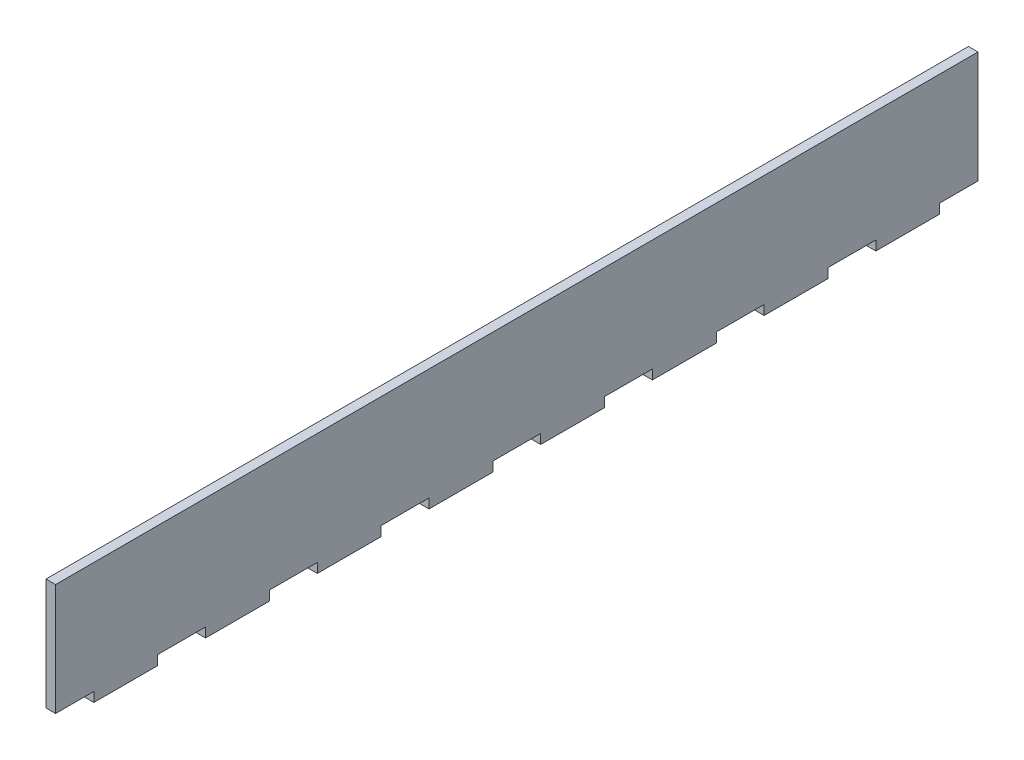
ISO-10303-21;
HEADER;
FILE_DESCRIPTION(('STEP AP214'),'2;1');
FILE_NAME('part.step','',(''),(''),'','','');
FILE_SCHEMA(('AUTOMOTIVE_DESIGN { 1 0 10303 214 1 1 1 1 }'));
ENDSEC;
DATA;
#1=APPLICATION_CONTEXT('core data for automotive mechanical design processes');
#2=APPLICATION_PROTOCOL_DEFINITION('international standard','automotive_design',2000,#1);
#3=PRODUCT_CONTEXT('',#1,'mechanical');
#4=PRODUCT('Part','Part','',(#3));
#5=PRODUCT_RELATED_PRODUCT_CATEGORY('part','',(#4));
#6=PRODUCT_DEFINITION_FORMATION('','',#4);
#7=PRODUCT_DEFINITION_CONTEXT('part definition',#1,'design');
#8=PRODUCT_DEFINITION('design','',#6,#7);
#9=PRODUCT_DEFINITION_SHAPE('','',#8);
#10=(LENGTH_UNIT() NAMED_UNIT(*) SI_UNIT(.MILLI.,.METRE.));
#11=(NAMED_UNIT(*) PLANE_ANGLE_UNIT() SI_UNIT($,.RADIAN.));
#12=(NAMED_UNIT(*) SI_UNIT($,.STERADIAN.) SOLID_ANGLE_UNIT());
#13=UNCERTAINTY_MEASURE_WITH_UNIT(LENGTH_MEASURE(1.E-05),#10,'distance_accuracy_value','');
#14=(GEOMETRIC_REPRESENTATION_CONTEXT(3) GLOBAL_UNCERTAINTY_ASSIGNED_CONTEXT((#13)) GLOBAL_UNIT_ASSIGNED_CONTEXT((#10,
#11,#12)) REPRESENTATION_CONTEXT('',''));
#15=CARTESIAN_POINT('',(0.,0.,0.));
#16=DIRECTION('',(0.,0.,1.));
#17=DIRECTION('',(1.,0.,0.));
#18=AXIS2_PLACEMENT_3D('',#15,#16,#17);
#19=CARTESIAN_POINT('',(3.,0.,0.));
#20=DIRECTION('',(0.,0.,1.));
#21=DIRECTION('',(1.,0.,0.));
#22=AXIS2_PLACEMENT_3D('',#19,#20,#21);
#23=PLANE('',#22);
#24=DIRECTION('',(0.,1.,0.));
#25=VECTOR('',#24,1.);
#26=CARTESIAN_POINT('',(0.,0.,0.));
#27=LINE('',#26,#25);
#28=CARTESIAN_POINT('',(0.,0.,0.));
#29=VERTEX_POINT('',#28);
#30=CARTESIAN_POINT('',(0.,35.,0.));
#31=VERTEX_POINT('',#30);
#32=EDGE_CURVE('E300',#29,#31,#27,.T.);
#33=ORIENTED_EDGE('',*,*,#32,.F.);
#34=DIRECTION('',(-1.,0.,0.));
#35=VECTOR('',#34,1.);
#36=CARTESIAN_POINT('',(3.,0.,0.));
#37=LINE('',#36,#35);
#38=CARTESIAN_POINT('',(3.,0.,0.));
#39=VERTEX_POINT('',#38);
#40=EDGE_CURVE('E11',#39,#29,#37,.T.);
#41=ORIENTED_EDGE('',*,*,#40,.F.);
#42=DIRECTION('',(0.,1.,0.));
#43=VECTOR('',#42,1.);
#44=CARTESIAN_POINT('',(3.,0.,0.));
#45=LINE('',#44,#43);
#46=CARTESIAN_POINT('',(3.,35.,0.));
#47=VERTEX_POINT('',#46);
#48=EDGE_CURVE('E387',#39,#47,#45,.T.);
#49=ORIENTED_EDGE('',*,*,#48,.T.);
#50=DIRECTION('',(-1.,0.,0.));
#51=VECTOR('',#50,1.);
#52=CARTESIAN_POINT('',(3.,35.,0.));
#53=LINE('',#52,#51);
#54=EDGE_CURVE('E36',#47,#31,#53,.T.);
#55=ORIENTED_EDGE('',*,*,#54,.T.);
#56=EDGE_LOOP('',(#33,#41,#49,#55));
#57=FACE_BOUND('',#56,.T.);
#58=ADVANCED_FACE('F33',(#57),#23,.T.);
#59=CARTESIAN_POINT('',(3.,0.,0.));
#60=DIRECTION('',(0.,1.,0.));
#61=DIRECTION('',(0.,0.,1.));
#62=AXIS2_PLACEMENT_3D('',#59,#60,#61);
#63=PLANE('',#62);
#64=DIRECTION('',(0.,0.,-1.));
#65=VECTOR('',#64,1.);
#66=CARTESIAN_POINT('',(0.,0.,0.));
#67=LINE('',#66,#65);
#68=CARTESIAN_POINT('',(0.,0.,-12.));
#69=VERTEX_POINT('',#68);
#70=EDGE_CURVE('E162',#29,#69,#67,.T.);
#71=ORIENTED_EDGE('',*,*,#70,.T.);
#72=DIRECTION('',(-1.,0.,0.));
#73=VECTOR('',#72,1.);
#74=CARTESIAN_POINT('',(3.,0.,-12.));
#75=LINE('',#74,#73);
#76=CARTESIAN_POINT('',(3.,0.,-12.));
#77=VERTEX_POINT('',#76);
#78=EDGE_CURVE('E42',#77,#69,#75,.T.);
#79=ORIENTED_EDGE('',*,*,#78,.F.);
#80=DIRECTION('',(0.,0.,-1.));
#81=VECTOR('',#80,1.);
#82=CARTESIAN_POINT('',(3.,0.,0.));
#83=LINE('',#82,#81);
#84=EDGE_CURVE('E278',#39,#77,#83,.T.);
#85=ORIENTED_EDGE('',*,*,#84,.F.);
#86=ORIENTED_EDGE('',*,*,#40,.T.);
#87=EDGE_LOOP('',(#71,#79,#85,#86));
#88=FACE_BOUND('',#87,.T.);
#89=ADVANCED_FACE('F691',(#88),#63,.F.);
#90=CARTESIAN_POINT('',(3.,0.,-12.));
#91=DIRECTION('',(0.,0.,-1.));
#92=DIRECTION('',(0.,1.,0.));
#93=AXIS2_PLACEMENT_3D('',#90,#91,#92);
#94=PLANE('',#93);
#95=DIRECTION('',(0.,-1.,0.));
#96=VECTOR('',#95,1.);
#97=CARTESIAN_POINT('',(0.,0.,-12.));
#98=LINE('',#97,#96);
#99=CARTESIAN_POINT('',(0.,-3.,-12.));
#100=VERTEX_POINT('',#99);
#101=EDGE_CURVE('E285',#69,#100,#98,.T.);
#102=ORIENTED_EDGE('',*,*,#101,.T.);
#103=DIRECTION('',(-1.,0.,0.));
#104=VECTOR('',#103,1.);
#105=CARTESIAN_POINT('',(3.,-3.,-12.));
#106=LINE('',#105,#104);
#107=CARTESIAN_POINT('',(3.,-3.,-12.));
#108=VERTEX_POINT('',#107);
#109=EDGE_CURVE('E282',#108,#100,#106,.T.);
#110=ORIENTED_EDGE('',*,*,#109,.F.);
#111=DIRECTION('',(0.,-1.,0.));
#112=VECTOR('',#111,1.);
#113=CARTESIAN_POINT('',(3.,0.,-12.));
#114=LINE('',#113,#112);
#115=EDGE_CURVE('E270',#77,#108,#114,.T.);
#116=ORIENTED_EDGE('',*,*,#115,.F.);
#117=ORIENTED_EDGE('',*,*,#78,.T.);
#118=EDGE_LOOP('',(#102,#110,#116,#117));
#119=FACE_BOUND('',#118,.T.);
#120=ADVANCED_FACE('F283',(#119),#94,.F.);
#121=CARTESIAN_POINT('',(3.,-3.,-12.));
#122=DIRECTION('',(0.,1.,0.));
#123=DIRECTION('',(0.,0.,1.));
#124=AXIS2_PLACEMENT_3D('',#121,#122,#123);
#125=PLANE('',#124);
#126=DIRECTION('',(0.,0.,-1.));
#127=VECTOR('',#126,1.);
#128=CARTESIAN_POINT('',(0.,-3.,-12.));
#129=LINE('',#128,#127);
#130=CARTESIAN_POINT('',(0.,-3.,-32.));
#131=VERTEX_POINT('',#130);
#132=EDGE_CURVE('E384',#100,#131,#129,.T.);
#133=ORIENTED_EDGE('',*,*,#132,.T.);
#134=DIRECTION('',(-1.,0.,0.));
#135=VECTOR('',#134,1.);
#136=CARTESIAN_POINT('',(3.,-3.,-32.));
#137=LINE('',#136,#135);
#138=CARTESIAN_POINT('',(3.,-3.,-32.));
#139=VERTEX_POINT('',#138);
#140=EDGE_CURVE('E289',#139,#131,#137,.T.);
#141=ORIENTED_EDGE('',*,*,#140,.F.);
#142=DIRECTION('',(0.,0.,-1.));
#143=VECTOR('',#142,1.);
#144=CARTESIAN_POINT('',(3.,-3.,-12.));
#145=LINE('',#144,#143);
#146=EDGE_CURVE('E276',#108,#139,#145,.T.);
#147=ORIENTED_EDGE('',*,*,#146,.F.);
#148=ORIENTED_EDGE('',*,*,#109,.T.);
#149=EDGE_LOOP('',(#133,#141,#147,#148));
#150=FACE_BOUND('',#149,.T.);
#151=ADVANCED_FACE('F291',(#150),#125,.F.);
#152=CARTESIAN_POINT('',(3.,0.,-32.));
#153=DIRECTION('',(0.,0.,-1.));
#154=DIRECTION('',(-1.,0.,0.));
#155=AXIS2_PLACEMENT_3D('',#152,#153,#154);
#156=PLANE('',#155);
#157=DIRECTION('',(0.,-1.,0.));
#158=VECTOR('',#157,1.);
#159=CARTESIAN_POINT('',(0.,0.,-32.));
#160=LINE('',#159,#158);
#161=CARTESIAN_POINT('',(0.,0.,-32.));
#162=VERTEX_POINT('',#161);
#163=EDGE_CURVE('E381',#162,#131,#160,.T.);
#164=ORIENTED_EDGE('',*,*,#163,.F.);
#165=DIRECTION('',(-1.,0.,0.));
#166=VECTOR('',#165,1.);
#167=CARTESIAN_POINT('',(3.,0.,-32.));
#168=LINE('',#167,#166);
#169=CARTESIAN_POINT('',(3.,0.,-32.));
#170=VERTEX_POINT('',#169);
#171=EDGE_CURVE('E391',#170,#162,#168,.T.);
#172=ORIENTED_EDGE('',*,*,#171,.F.);
#173=DIRECTION('',(0.,-1.,0.));
#174=VECTOR('',#173,1.);
#175=CARTESIAN_POINT('',(3.,0.,-32.));
#176=LINE('',#175,#174);
#177=EDGE_CURVE('E293',#170,#139,#176,.T.);
#178=ORIENTED_EDGE('',*,*,#177,.T.);
#179=ORIENTED_EDGE('',*,*,#140,.T.);
#180=EDGE_LOOP('',(#164,#172,#178,#179));
#181=FACE_BOUND('',#180,.T.);
#182=ADVANCED_FACE('F475',(#181),#156,.T.);
#183=CARTESIAN_POINT('',(3.,0.,-32.));
#184=DIRECTION('',(0.,1.,0.));
#185=DIRECTION('',(0.,0.,1.));
#186=AXIS2_PLACEMENT_3D('',#183,#184,#185);
#187=PLANE('',#186);
#188=DIRECTION('',(0.,0.,-1.));
#189=VECTOR('',#188,1.);
#190=CARTESIAN_POINT('',(0.,0.,-32.));
#191=LINE('',#190,#189);
#192=CARTESIAN_POINT('',(0.,0.,-47.));
#193=VERTEX_POINT('',#192);
#194=EDGE_CURVE('E379',#162,#193,#191,.T.);
#195=ORIENTED_EDGE('',*,*,#194,.T.);
#196=DIRECTION('',(-1.,0.,0.));
#197=VECTOR('',#196,1.);
#198=CARTESIAN_POINT('',(3.,0.,-47.));
#199=LINE('',#198,#197);
#200=CARTESIAN_POINT('',(3.,0.,-47.));
#201=VERTEX_POINT('',#200);
#202=EDGE_CURVE('E393',#201,#193,#199,.T.);
#203=ORIENTED_EDGE('',*,*,#202,.F.);
#204=DIRECTION('',(0.,0.,-1.));
#205=VECTOR('',#204,1.);
#206=CARTESIAN_POINT('',(3.,0.,-32.));
#207=LINE('',#206,#205);
#208=EDGE_CURVE('E295',#170,#201,#207,.T.);
#209=ORIENTED_EDGE('',*,*,#208,.F.);
#210=ORIENTED_EDGE('',*,*,#171,.T.);
#211=EDGE_LOOP('',(#195,#203,#209,#210));
#212=FACE_BOUND('',#211,.T.);
#213=ADVANCED_FACE('F482',(#212),#187,.F.);
#214=CARTESIAN_POINT('',(3.,0.,-47.));
#215=DIRECTION('',(0.,0.,-1.));
#216=DIRECTION('',(0.,1.,0.));
#217=AXIS2_PLACEMENT_3D('',#214,#215,#216);
#218=PLANE('',#217);
#219=DIRECTION('',(0.,-1.,0.));
#220=VECTOR('',#219,1.);
#221=CARTESIAN_POINT('',(0.,0.,-47.));
#222=LINE('',#221,#220);
#223=CARTESIAN_POINT('',(0.,-3.,-47.));
#224=VERTEX_POINT('',#223);
#225=EDGE_CURVE('E377',#193,#224,#222,.T.);
#226=ORIENTED_EDGE('',*,*,#225,.T.);
#227=DIRECTION('',(-1.,0.,0.));
#228=VECTOR('',#227,1.);
#229=CARTESIAN_POINT('',(3.,-3.,-47.));
#230=LINE('',#229,#228);
#231=CARTESIAN_POINT('',(3.,-3.,-47.));
#232=VERTEX_POINT('',#231);
#233=EDGE_CURVE('E396',#232,#224,#230,.T.);
#234=ORIENTED_EDGE('',*,*,#233,.F.);
#235=DIRECTION('',(0.,-1.,0.));
#236=VECTOR('',#235,1.);
#237=CARTESIAN_POINT('',(3.,0.,-47.));
#238=LINE('',#237,#236);
#239=EDGE_CURVE('E479',#201,#232,#238,.T.);
#240=ORIENTED_EDGE('',*,*,#239,.F.);
#241=ORIENTED_EDGE('',*,*,#202,.T.);
#242=EDGE_LOOP('',(#226,#234,#240,#241));
#243=FACE_BOUND('',#242,.T.);
#244=ADVANCED_FACE('F484',(#243),#218,.F.);
#245=CARTESIAN_POINT('',(3.,-3.,-47.));
#246=DIRECTION('',(0.,1.,0.));
#247=DIRECTION('',(0.,0.,1.));
#248=AXIS2_PLACEMENT_3D('',#245,#246,#247);
#249=PLANE('',#248);
#250=DIRECTION('',(0.,0.,-1.));
#251=VECTOR('',#250,1.);
#252=CARTESIAN_POINT('',(0.,-3.,-47.));
#253=LINE('',#252,#251);
#254=CARTESIAN_POINT('',(0.,-3.,-67.));
#255=VERTEX_POINT('',#254);
#256=EDGE_CURVE('E374',#224,#255,#253,.T.);
#257=ORIENTED_EDGE('',*,*,#256,.T.);
#258=DIRECTION('',(-1.,0.,0.));
#259=VECTOR('',#258,1.);
#260=CARTESIAN_POINT('',(3.,-3.,-67.));
#261=LINE('',#260,#259);
#262=CARTESIAN_POINT('',(3.,-3.,-67.));
#263=VERTEX_POINT('',#262);
#264=EDGE_CURVE('E399',#263,#255,#261,.T.);
#265=ORIENTED_EDGE('',*,*,#264,.F.);
#266=DIRECTION('',(0.,0.,-1.));
#267=VECTOR('',#266,1.);
#268=CARTESIAN_POINT('',(3.,-3.,-47.));
#269=LINE('',#268,#267);
#270=EDGE_CURVE('E486',#232,#263,#269,.T.);
#271=ORIENTED_EDGE('',*,*,#270,.F.);
#272=ORIENTED_EDGE('',*,*,#233,.T.);
#273=EDGE_LOOP('',(#257,#265,#271,#272));
#274=FACE_BOUND('',#273,.T.);
#275=ADVANCED_FACE('F681',(#274),#249,.F.);
#276=CARTESIAN_POINT('',(3.,0.,-67.));
#277=DIRECTION('',(0.,0.,-1.));
#278=DIRECTION('',(-1.,0.,0.));
#279=AXIS2_PLACEMENT_3D('',#276,#277,#278);
#280=PLANE('',#279);
#281=DIRECTION('',(0.,-1.,0.));
#282=VECTOR('',#281,1.);
#283=CARTESIAN_POINT('',(0.,0.,-67.));
#284=LINE('',#283,#282);
#285=CARTESIAN_POINT('',(0.,0.,-67.));
#286=VERTEX_POINT('',#285);
#287=EDGE_CURVE('E371',#286,#255,#284,.T.);
#288=ORIENTED_EDGE('',*,*,#287,.F.);
#289=DIRECTION('',(-1.,0.,0.));
#290=VECTOR('',#289,1.);
#291=CARTESIAN_POINT('',(3.,0.,-67.));
#292=LINE('',#291,#290);
#293=CARTESIAN_POINT('',(3.,0.,-67.));
#294=VERTEX_POINT('',#293);
#295=EDGE_CURVE('E401',#294,#286,#292,.T.);
#296=ORIENTED_EDGE('',*,*,#295,.F.);
#297=DIRECTION('',(0.,-1.,0.));
#298=VECTOR('',#297,1.);
#299=CARTESIAN_POINT('',(3.,0.,-67.));
#300=LINE('',#299,#298);
#301=EDGE_CURVE('E488',#294,#263,#300,.T.);
#302=ORIENTED_EDGE('',*,*,#301,.T.);
#303=ORIENTED_EDGE('',*,*,#264,.T.);
#304=EDGE_LOOP('',(#288,#296,#302,#303));
#305=FACE_BOUND('',#304,.T.);
#306=ADVANCED_FACE('F678',(#305),#280,.T.);
#307=CARTESIAN_POINT('',(3.,0.,-67.));
#308=DIRECTION('',(0.,1.,0.));
#309=DIRECTION('',(0.,0.,1.));
#310=AXIS2_PLACEMENT_3D('',#307,#308,#309);
#311=PLANE('',#310);
#312=DIRECTION('',(0.,0.,-1.));
#313=VECTOR('',#312,1.);
#314=CARTESIAN_POINT('',(0.,0.,-67.));
#315=LINE('',#314,#313);
#316=CARTESIAN_POINT('',(0.,0.,-82.));
#317=VERTEX_POINT('',#316);
#318=EDGE_CURVE('E369',#286,#317,#315,.T.);
#319=ORIENTED_EDGE('',*,*,#318,.T.);
#320=DIRECTION('',(-1.,0.,0.));
#321=VECTOR('',#320,1.);
#322=CARTESIAN_POINT('',(3.,0.,-82.));
#323=LINE('',#322,#321);
#324=CARTESIAN_POINT('',(3.,0.,-82.));
#325=VERTEX_POINT('',#324);
#326=EDGE_CURVE('E403',#325,#317,#323,.T.);
#327=ORIENTED_EDGE('',*,*,#326,.F.);
#328=DIRECTION('',(0.,0.,-1.));
#329=VECTOR('',#328,1.);
#330=CARTESIAN_POINT('',(3.,0.,-67.));
#331=LINE('',#330,#329);
#332=EDGE_CURVE('E493',#294,#325,#331,.T.);
#333=ORIENTED_EDGE('',*,*,#332,.F.);
#334=ORIENTED_EDGE('',*,*,#295,.T.);
#335=EDGE_LOOP('',(#319,#327,#333,#334));
#336=FACE_BOUND('',#335,.T.);
#337=ADVANCED_FACE('F673',(#336),#311,.F.);
#338=CARTESIAN_POINT('',(3.,0.,-82.));
#339=DIRECTION('',(0.,0.,-1.));
#340=DIRECTION('',(0.,1.,0.));
#341=AXIS2_PLACEMENT_3D('',#338,#339,#340);
#342=PLANE('',#341);
#343=DIRECTION('',(0.,-1.,0.));
#344=VECTOR('',#343,1.);
#345=CARTESIAN_POINT('',(0.,0.,-82.));
#346=LINE('',#345,#344);
#347=CARTESIAN_POINT('',(0.,-3.,-82.));
#348=VERTEX_POINT('',#347);
#349=EDGE_CURVE('E367',#317,#348,#346,.T.);
#350=ORIENTED_EDGE('',*,*,#349,.T.);
#351=DIRECTION('',(-1.,0.,0.));
#352=VECTOR('',#351,1.);
#353=CARTESIAN_POINT('',(3.,-3.,-82.));
#354=LINE('',#353,#352);
#355=CARTESIAN_POINT('',(3.,-3.,-82.));
#356=VERTEX_POINT('',#355);
#357=EDGE_CURVE('E406',#356,#348,#354,.T.);
#358=ORIENTED_EDGE('',*,*,#357,.F.);
#359=DIRECTION('',(0.,-1.,0.));
#360=VECTOR('',#359,1.);
#361=CARTESIAN_POINT('',(3.,0.,-82.));
#362=LINE('',#361,#360);
#363=EDGE_CURVE('E495',#325,#356,#362,.T.);
#364=ORIENTED_EDGE('',*,*,#363,.F.);
#365=ORIENTED_EDGE('',*,*,#326,.T.);
#366=EDGE_LOOP('',(#350,#358,#364,#365));
#367=FACE_BOUND('',#366,.T.);
#368=ADVANCED_FACE('F669',(#367),#342,.F.);
#369=CARTESIAN_POINT('',(3.,-3.,-82.));
#370=DIRECTION('',(0.,1.,0.));
#371=DIRECTION('',(0.,0.,1.));
#372=AXIS2_PLACEMENT_3D('',#369,#370,#371);
#373=PLANE('',#372);
#374=DIRECTION('',(0.,0.,-1.));
#375=VECTOR('',#374,1.);
#376=CARTESIAN_POINT('',(0.,-3.,-82.));
#377=LINE('',#376,#375);
#378=CARTESIAN_POINT('',(0.,-3.,-102.));
#379=VERTEX_POINT('',#378);
#380=EDGE_CURVE('E364',#348,#379,#377,.T.);
#381=ORIENTED_EDGE('',*,*,#380,.T.);
#382=DIRECTION('',(-1.,0.,0.));
#383=VECTOR('',#382,1.);
#384=CARTESIAN_POINT('',(3.,-3.,-102.));
#385=LINE('',#384,#383);
#386=CARTESIAN_POINT('',(3.,-3.,-102.));
#387=VERTEX_POINT('',#386);
#388=EDGE_CURVE('E409',#387,#379,#385,.T.);
#389=ORIENTED_EDGE('',*,*,#388,.F.);
#390=DIRECTION('',(0.,0.,-1.));
#391=VECTOR('',#390,1.);
#392=CARTESIAN_POINT('',(3.,-3.,-82.));
#393=LINE('',#392,#391);
#394=EDGE_CURVE('E497',#356,#387,#393,.T.);
#395=ORIENTED_EDGE('',*,*,#394,.F.);
#396=ORIENTED_EDGE('',*,*,#357,.T.);
#397=EDGE_LOOP('',(#381,#389,#395,#396));
#398=FACE_BOUND('',#397,.T.);
#399=ADVANCED_FACE('F664',(#398),#373,.F.);
#400=CARTESIAN_POINT('',(3.,0.,-102.));
#401=DIRECTION('',(0.,0.,-1.));
#402=DIRECTION('',(-1.,0.,0.));
#403=AXIS2_PLACEMENT_3D('',#400,#401,#402);
#404=PLANE('',#403);
#405=DIRECTION('',(0.,-1.,0.));
#406=VECTOR('',#405,1.);
#407=CARTESIAN_POINT('',(0.,0.,-102.));
#408=LINE('',#407,#406);
#409=CARTESIAN_POINT('',(0.,0.,-102.));
#410=VERTEX_POINT('',#409);
#411=EDGE_CURVE('E361',#410,#379,#408,.T.);
#412=ORIENTED_EDGE('',*,*,#411,.F.);
#413=DIRECTION('',(-1.,0.,0.));
#414=VECTOR('',#413,1.);
#415=CARTESIAN_POINT('',(3.,0.,-102.));
#416=LINE('',#415,#414);
#417=CARTESIAN_POINT('',(3.,0.,-102.));
#418=VERTEX_POINT('',#417);
#419=EDGE_CURVE('E411',#418,#410,#416,.T.);
#420=ORIENTED_EDGE('',*,*,#419,.F.);
#421=DIRECTION('',(0.,-1.,0.));
#422=VECTOR('',#421,1.);
#423=CARTESIAN_POINT('',(3.,0.,-102.));
#424=LINE('',#423,#422);
#425=EDGE_CURVE('E499',#418,#387,#424,.T.);
#426=ORIENTED_EDGE('',*,*,#425,.T.);
#427=ORIENTED_EDGE('',*,*,#388,.T.);
#428=EDGE_LOOP('',(#412,#420,#426,#427));
#429=FACE_BOUND('',#428,.T.);
#430=ADVANCED_FACE('F658',(#429),#404,.T.);
#431=CARTESIAN_POINT('',(3.,0.,-102.));
#432=DIRECTION('',(0.,1.,0.));
#433=DIRECTION('',(0.,0.,1.));
#434=AXIS2_PLACEMENT_3D('',#431,#432,#433);
#435=PLANE('',#434);
#436=DIRECTION('',(0.,0.,-1.));
#437=VECTOR('',#436,1.);
#438=CARTESIAN_POINT('',(0.,0.,-102.));
#439=LINE('',#438,#437);
#440=CARTESIAN_POINT('',(0.,0.,-117.));
#441=VERTEX_POINT('',#440);
#442=EDGE_CURVE('E359',#410,#441,#439,.T.);
#443=ORIENTED_EDGE('',*,*,#442,.T.);
#444=DIRECTION('',(-1.,0.,0.));
#445=VECTOR('',#444,1.);
#446=CARTESIAN_POINT('',(3.,0.,-117.));
#447=LINE('',#446,#445);
#448=CARTESIAN_POINT('',(3.,0.,-117.));
#449=VERTEX_POINT('',#448);
#450=EDGE_CURVE('E413',#449,#441,#447,.T.);
#451=ORIENTED_EDGE('',*,*,#450,.F.);
#452=DIRECTION('',(0.,0.,-1.));
#453=VECTOR('',#452,1.);
#454=CARTESIAN_POINT('',(3.,0.,-102.));
#455=LINE('',#454,#453);
#456=EDGE_CURVE('E502',#418,#449,#455,.T.);
#457=ORIENTED_EDGE('',*,*,#456,.F.);
#458=ORIENTED_EDGE('',*,*,#419,.T.);
#459=EDGE_LOOP('',(#443,#451,#457,#458));
#460=FACE_BOUND('',#459,.T.);
#461=ADVANCED_FACE('F655',(#460),#435,.F.);
#462=CARTESIAN_POINT('',(3.,0.,-117.));
#463=DIRECTION('',(0.,0.,-1.));
#464=DIRECTION('',(0.,1.,0.));
#465=AXIS2_PLACEMENT_3D('',#462,#463,#464);
#466=PLANE('',#465);
#467=DIRECTION('',(0.,-1.,0.));
#468=VECTOR('',#467,1.);
#469=CARTESIAN_POINT('',(0.,0.,-117.));
#470=LINE('',#469,#468);
#471=CARTESIAN_POINT('',(0.,-3.,-117.));
#472=VERTEX_POINT('',#471);
#473=EDGE_CURVE('E357',#441,#472,#470,.T.);
#474=ORIENTED_EDGE('',*,*,#473,.T.);
#475=DIRECTION('',(-1.,0.,0.));
#476=VECTOR('',#475,1.);
#477=CARTESIAN_POINT('',(3.,-3.,-117.));
#478=LINE('',#477,#476);
#479=CARTESIAN_POINT('',(3.,-3.,-117.));
#480=VERTEX_POINT('',#479);
#481=EDGE_CURVE('E416',#480,#472,#478,.T.);
#482=ORIENTED_EDGE('',*,*,#481,.F.);
#483=DIRECTION('',(0.,-1.,0.));
#484=VECTOR('',#483,1.);
#485=CARTESIAN_POINT('',(3.,0.,-117.));
#486=LINE('',#485,#484);
#487=EDGE_CURVE('E504',#449,#480,#486,.T.);
#488=ORIENTED_EDGE('',*,*,#487,.F.);
#489=ORIENTED_EDGE('',*,*,#450,.T.);
#490=EDGE_LOOP('',(#474,#482,#488,#489));
#491=FACE_BOUND('',#490,.T.);
#492=ADVANCED_FACE('F650',(#491),#466,.F.);
#493=CARTESIAN_POINT('',(3.,-3.,-117.));
#494=DIRECTION('',(0.,1.,0.));
#495=DIRECTION('',(0.,0.,1.));
#496=AXIS2_PLACEMENT_3D('',#493,#494,#495);
#497=PLANE('',#496);
#498=DIRECTION('',(0.,0.,-1.));
#499=VECTOR('',#498,1.);
#500=CARTESIAN_POINT('',(0.,-3.,-117.));
#501=LINE('',#500,#499);
#502=CARTESIAN_POINT('',(0.,-3.,-137.));
#503=VERTEX_POINT('',#502);
#504=EDGE_CURVE('E354',#472,#503,#501,.T.);
#505=ORIENTED_EDGE('',*,*,#504,.T.);
#506=DIRECTION('',(-1.,0.,0.));
#507=VECTOR('',#506,1.);
#508=CARTESIAN_POINT('',(3.,-3.,-137.));
#509=LINE('',#508,#507);
#510=CARTESIAN_POINT('',(3.,-3.,-137.));
#511=VERTEX_POINT('',#510);
#512=EDGE_CURVE('E419',#511,#503,#509,.T.);
#513=ORIENTED_EDGE('',*,*,#512,.F.);
#514=DIRECTION('',(0.,0.,-1.));
#515=VECTOR('',#514,1.);
#516=CARTESIAN_POINT('',(3.,-3.,-117.));
#517=LINE('',#516,#515);
#518=EDGE_CURVE('E506',#480,#511,#517,.T.);
#519=ORIENTED_EDGE('',*,*,#518,.F.);
#520=ORIENTED_EDGE('',*,*,#481,.T.);
#521=EDGE_LOOP('',(#505,#513,#519,#520));
#522=FACE_BOUND('',#521,.T.);
#523=ADVANCED_FACE('F644',(#522),#497,.F.);
#524=CARTESIAN_POINT('',(3.,0.,-137.));
#525=DIRECTION('',(0.,0.,-1.));
#526=DIRECTION('',(-1.,0.,0.));
#527=AXIS2_PLACEMENT_3D('',#524,#525,#526);
#528=PLANE('',#527);
#529=DIRECTION('',(0.,-1.,0.));
#530=VECTOR('',#529,1.);
#531=CARTESIAN_POINT('',(0.,0.,-137.));
#532=LINE('',#531,#530);
#533=CARTESIAN_POINT('',(0.,0.,-137.));
#534=VERTEX_POINT('',#533);
#535=EDGE_CURVE('E351',#534,#503,#532,.T.);
#536=ORIENTED_EDGE('',*,*,#535,.F.);
#537=DIRECTION('',(-1.,0.,0.));
#538=VECTOR('',#537,1.);
#539=CARTESIAN_POINT('',(3.,0.,-137.));
#540=LINE('',#539,#538);
#541=CARTESIAN_POINT('',(3.,0.,-137.));
#542=VERTEX_POINT('',#541);
#543=EDGE_CURVE('E421',#542,#534,#540,.T.);
#544=ORIENTED_EDGE('',*,*,#543,.F.);
#545=DIRECTION('',(0.,-1.,0.));
#546=VECTOR('',#545,1.);
#547=CARTESIAN_POINT('',(3.,0.,-137.));
#548=LINE('',#547,#546);
#549=EDGE_CURVE('E508',#542,#511,#548,.T.);
#550=ORIENTED_EDGE('',*,*,#549,.T.);
#551=ORIENTED_EDGE('',*,*,#512,.T.);
#552=EDGE_LOOP('',(#536,#544,#550,#551));
#553=FACE_BOUND('',#552,.T.);
#554=ADVANCED_FACE('F640',(#553),#528,.T.);
#555=CARTESIAN_POINT('',(3.,0.,-137.));
#556=DIRECTION('',(0.,1.,0.));
#557=DIRECTION('',(0.,0.,1.));
#558=AXIS2_PLACEMENT_3D('',#555,#556,#557);
#559=PLANE('',#558);
#560=DIRECTION('',(0.,0.,-1.));
#561=VECTOR('',#560,1.);
#562=CARTESIAN_POINT('',(0.,0.,-137.));
#563=LINE('',#562,#561);
#564=CARTESIAN_POINT('',(0.,0.,-152.));
#565=VERTEX_POINT('',#564);
#566=EDGE_CURVE('E349',#534,#565,#563,.T.);
#567=ORIENTED_EDGE('',*,*,#566,.T.);
#568=DIRECTION('',(-1.,0.,0.));
#569=VECTOR('',#568,1.);
#570=CARTESIAN_POINT('',(3.,0.,-152.));
#571=LINE('',#570,#569);
#572=CARTESIAN_POINT('',(3.,0.,-152.));
#573=VERTEX_POINT('',#572);
#574=EDGE_CURVE('E423',#573,#565,#571,.T.);
#575=ORIENTED_EDGE('',*,*,#574,.F.);
#576=DIRECTION('',(0.,0.,-1.));
#577=VECTOR('',#576,1.);
#578=CARTESIAN_POINT('',(3.,0.,-137.));
#579=LINE('',#578,#577);
#580=EDGE_CURVE('E511',#542,#573,#579,.T.);
#581=ORIENTED_EDGE('',*,*,#580,.F.);
#582=ORIENTED_EDGE('',*,*,#543,.T.);
#583=EDGE_LOOP('',(#567,#575,#581,#582));
#584=FACE_BOUND('',#583,.T.);
#585=ADVANCED_FACE('F635',(#584),#559,.F.);
#586=CARTESIAN_POINT('',(3.,0.,-152.));
#587=DIRECTION('',(0.,0.,-1.));
#588=DIRECTION('',(-1.,0.,0.));
#589=AXIS2_PLACEMENT_3D('',#586,#587,#588);
#590=PLANE('',#589);
#591=DIRECTION('',(0.,-1.,0.));
#592=VECTOR('',#591,1.);
#593=CARTESIAN_POINT('',(0.,0.,-152.));
#594=LINE('',#593,#592);
#595=CARTESIAN_POINT('',(0.,-3.,-152.));
#596=VERTEX_POINT('',#595);
#597=EDGE_CURVE('E347',#565,#596,#594,.T.);
#598=ORIENTED_EDGE('',*,*,#597,.T.);
#599=DIRECTION('',(-1.,0.,0.));
#600=VECTOR('',#599,1.);
#601=CARTESIAN_POINT('',(3.,-3.,-152.));
#602=LINE('',#601,#600);
#603=CARTESIAN_POINT('',(3.,-3.,-152.));
#604=VERTEX_POINT('',#603);
#605=EDGE_CURVE('E426',#604,#596,#602,.T.);
#606=ORIENTED_EDGE('',*,*,#605,.F.);
#607=DIRECTION('',(0.,-1.,0.));
#608=VECTOR('',#607,1.);
#609=CARTESIAN_POINT('',(3.,0.,-152.));
#610=LINE('',#609,#608);
#611=EDGE_CURVE('E513',#573,#604,#610,.T.);
#612=ORIENTED_EDGE('',*,*,#611,.F.);
#613=ORIENTED_EDGE('',*,*,#574,.T.);
#614=EDGE_LOOP('',(#598,#606,#612,#613));
#615=FACE_BOUND('',#614,.T.);
#616=ADVANCED_FACE('F631',(#615),#590,.F.);
#617=CARTESIAN_POINT('',(3.,-3.,-152.));
#618=DIRECTION('',(0.,1.,0.));
#619=DIRECTION('',(0.,0.,1.));
#620=AXIS2_PLACEMENT_3D('',#617,#618,#619);
#621=PLANE('',#620);
#622=DIRECTION('',(0.,0.,-1.));
#623=VECTOR('',#622,1.);
#624=CARTESIAN_POINT('',(0.,-3.,-152.));
#625=LINE('',#624,#623);
#626=CARTESIAN_POINT('',(0.,-3.,-172.));
#627=VERTEX_POINT('',#626);
#628=EDGE_CURVE('E344',#596,#627,#625,.T.);
#629=ORIENTED_EDGE('',*,*,#628,.T.);
#630=DIRECTION('',(-1.,0.,0.));
#631=VECTOR('',#630,1.);
#632=CARTESIAN_POINT('',(3.,-3.,-172.));
#633=LINE('',#632,#631);
#634=CARTESIAN_POINT('',(3.,-3.,-172.));
#635=VERTEX_POINT('',#634);
#636=EDGE_CURVE('E429',#635,#627,#633,.T.);
#637=ORIENTED_EDGE('',*,*,#636,.F.);
#638=DIRECTION('',(0.,0.,-1.));
#639=VECTOR('',#638,1.);
#640=CARTESIAN_POINT('',(3.,-3.,-152.));
#641=LINE('',#640,#639);
#642=EDGE_CURVE('E515',#604,#635,#641,.T.);
#643=ORIENTED_EDGE('',*,*,#642,.F.);
#644=ORIENTED_EDGE('',*,*,#605,.T.);
#645=EDGE_LOOP('',(#629,#637,#643,#644));
#646=FACE_BOUND('',#645,.T.);
#647=ADVANCED_FACE('F626',(#646),#621,.F.);
#648=CARTESIAN_POINT('',(3.,0.,-172.));
#649=DIRECTION('',(0.,0.,-1.));
#650=DIRECTION('',(-1.,0.,0.));
#651=AXIS2_PLACEMENT_3D('',#648,#649,#650);
#652=PLANE('',#651);
#653=DIRECTION('',(0.,-1.,0.));
#654=VECTOR('',#653,1.);
#655=CARTESIAN_POINT('',(0.,0.,-172.));
#656=LINE('',#655,#654);
#657=CARTESIAN_POINT('',(0.,0.,-172.));
#658=VERTEX_POINT('',#657);
#659=EDGE_CURVE('E341',#658,#627,#656,.T.);
#660=ORIENTED_EDGE('',*,*,#659,.F.);
#661=DIRECTION('',(-1.,0.,0.));
#662=VECTOR('',#661,1.);
#663=CARTESIAN_POINT('',(3.,0.,-172.));
#664=LINE('',#663,#662);
#665=CARTESIAN_POINT('',(3.,0.,-172.));
#666=VERTEX_POINT('',#665);
#667=EDGE_CURVE('E431',#666,#658,#664,.T.);
#668=ORIENTED_EDGE('',*,*,#667,.F.);
#669=DIRECTION('',(0.,-1.,0.));
#670=VECTOR('',#669,1.);
#671=CARTESIAN_POINT('',(3.,0.,-172.));
#672=LINE('',#671,#670);
#673=EDGE_CURVE('E517',#666,#635,#672,.T.);
#674=ORIENTED_EDGE('',*,*,#673,.T.);
#675=ORIENTED_EDGE('',*,*,#636,.T.);
#676=EDGE_LOOP('',(#660,#668,#674,#675));
#677=FACE_BOUND('',#676,.T.);
#678=ADVANCED_FACE('F620',(#677),#652,.T.);
#679=CARTESIAN_POINT('',(3.,0.,-172.));
#680=DIRECTION('',(0.,1.,0.));
#681=DIRECTION('',(0.,0.,1.));
#682=AXIS2_PLACEMENT_3D('',#679,#680,#681);
#683=PLANE('',#682);
#684=DIRECTION('',(0.,0.,-1.));
#685=VECTOR('',#684,1.);
#686=CARTESIAN_POINT('',(0.,0.,-172.));
#687=LINE('',#686,#685);
#688=CARTESIAN_POINT('',(0.,0.,-187.));
#689=VERTEX_POINT('',#688);
#690=EDGE_CURVE('E339',#658,#689,#687,.T.);
#691=ORIENTED_EDGE('',*,*,#690,.T.);
#692=DIRECTION('',(-1.,0.,0.));
#693=VECTOR('',#692,1.);
#694=CARTESIAN_POINT('',(3.,0.,-187.));
#695=LINE('',#694,#693);
#696=CARTESIAN_POINT('',(3.,0.,-187.));
#697=VERTEX_POINT('',#696);
#698=EDGE_CURVE('E433',#697,#689,#695,.T.);
#699=ORIENTED_EDGE('',*,*,#698,.F.);
#700=DIRECTION('',(0.,0.,-1.));
#701=VECTOR('',#700,1.);
#702=CARTESIAN_POINT('',(3.,0.,-172.));
#703=LINE('',#702,#701);
#704=EDGE_CURVE('E520',#666,#697,#703,.T.);
#705=ORIENTED_EDGE('',*,*,#704,.F.);
#706=ORIENTED_EDGE('',*,*,#667,.T.);
#707=EDGE_LOOP('',(#691,#699,#705,#706));
#708=FACE_BOUND('',#707,.T.);
#709=ADVANCED_FACE('F617',(#708),#683,.F.);
#710=CARTESIAN_POINT('',(3.,0.,-187.));
#711=DIRECTION('',(0.,0.,-1.));
#712=DIRECTION('',(-1.,0.,0.));
#713=AXIS2_PLACEMENT_3D('',#710,#711,#712);
#714=PLANE('',#713);
#715=DIRECTION('',(0.,-1.,0.));
#716=VECTOR('',#715,1.);
#717=CARTESIAN_POINT('',(0.,0.,-187.));
#718=LINE('',#717,#716);
#719=CARTESIAN_POINT('',(0.,-3.,-187.));
#720=VERTEX_POINT('',#719);
#721=EDGE_CURVE('E337',#689,#720,#718,.T.);
#722=ORIENTED_EDGE('',*,*,#721,.T.);
#723=DIRECTION('',(-1.,0.,0.));
#724=VECTOR('',#723,1.);
#725=CARTESIAN_POINT('',(3.,-3.,-187.));
#726=LINE('',#725,#724);
#727=CARTESIAN_POINT('',(3.,-3.,-187.));
#728=VERTEX_POINT('',#727);
#729=EDGE_CURVE('E436',#728,#720,#726,.T.);
#730=ORIENTED_EDGE('',*,*,#729,.F.);
#731=DIRECTION('',(0.,-1.,0.));
#732=VECTOR('',#731,1.);
#733=CARTESIAN_POINT('',(3.,0.,-187.));
#734=LINE('',#733,#732);
#735=EDGE_CURVE('E522',#697,#728,#734,.T.);
#736=ORIENTED_EDGE('',*,*,#735,.F.);
#737=ORIENTED_EDGE('',*,*,#698,.T.);
#738=EDGE_LOOP('',(#722,#730,#736,#737));
#739=FACE_BOUND('',#738,.T.);
#740=ADVANCED_FACE('F612',(#739),#714,.F.);
#741=CARTESIAN_POINT('',(3.,-3.,-187.));
#742=DIRECTION('',(0.,1.,0.));
#743=DIRECTION('',(0.,0.,1.));
#744=AXIS2_PLACEMENT_3D('',#741,#742,#743);
#745=PLANE('',#744);
#746=DIRECTION('',(0.,0.,-1.));
#747=VECTOR('',#746,1.);
#748=CARTESIAN_POINT('',(0.,-3.,-187.));
#749=LINE('',#748,#747);
#750=CARTESIAN_POINT('',(0.,-3.,-207.));
#751=VERTEX_POINT('',#750);
#752=EDGE_CURVE('E334',#720,#751,#749,.T.);
#753=ORIENTED_EDGE('',*,*,#752,.T.);
#754=DIRECTION('',(-1.,0.,0.));
#755=VECTOR('',#754,1.);
#756=CARTESIAN_POINT('',(3.,-3.,-207.));
#757=LINE('',#756,#755);
#758=CARTESIAN_POINT('',(3.,-3.,-207.));
#759=VERTEX_POINT('',#758);
#760=EDGE_CURVE('E439',#759,#751,#757,.T.);
#761=ORIENTED_EDGE('',*,*,#760,.F.);
#762=DIRECTION('',(0.,0.,-1.));
#763=VECTOR('',#762,1.);
#764=CARTESIAN_POINT('',(3.,-3.,-187.));
#765=LINE('',#764,#763);
#766=EDGE_CURVE('E524',#728,#759,#765,.T.);
#767=ORIENTED_EDGE('',*,*,#766,.F.);
#768=ORIENTED_EDGE('',*,*,#729,.T.);
#769=EDGE_LOOP('',(#753,#761,#767,#768));
#770=FACE_BOUND('',#769,.T.);
#771=ADVANCED_FACE('F606',(#770),#745,.F.);
#772=CARTESIAN_POINT('',(3.,0.,-207.));
#773=DIRECTION('',(0.,0.,-1.));
#774=DIRECTION('',(-1.,0.,0.));
#775=AXIS2_PLACEMENT_3D('',#772,#773,#774);
#776=PLANE('',#775);
#777=DIRECTION('',(0.,-1.,0.));
#778=VECTOR('',#777,1.);
#779=CARTESIAN_POINT('',(0.,0.,-207.));
#780=LINE('',#779,#778);
#781=CARTESIAN_POINT('',(0.,0.,-207.));
#782=VERTEX_POINT('',#781);
#783=EDGE_CURVE('E331',#782,#751,#780,.T.);
#784=ORIENTED_EDGE('',*,*,#783,.F.);
#785=DIRECTION('',(-1.,0.,0.));
#786=VECTOR('',#785,1.);
#787=CARTESIAN_POINT('',(3.,0.,-207.));
#788=LINE('',#787,#786);
#789=CARTESIAN_POINT('',(3.,0.,-207.));
#790=VERTEX_POINT('',#789);
#791=EDGE_CURVE('E441',#790,#782,#788,.T.);
#792=ORIENTED_EDGE('',*,*,#791,.F.);
#793=DIRECTION('',(0.,-1.,0.));
#794=VECTOR('',#793,1.);
#795=CARTESIAN_POINT('',(3.,0.,-207.));
#796=LINE('',#795,#794);
#797=EDGE_CURVE('E526',#790,#759,#796,.T.);
#798=ORIENTED_EDGE('',*,*,#797,.T.);
#799=ORIENTED_EDGE('',*,*,#760,.T.);
#800=EDGE_LOOP('',(#784,#792,#798,#799));
#801=FACE_BOUND('',#800,.T.);
#802=ADVANCED_FACE('F602',(#801),#776,.T.);
#803=CARTESIAN_POINT('',(3.,0.,-207.));
#804=DIRECTION('',(0.,1.,0.));
#805=DIRECTION('',(0.,0.,1.));
#806=AXIS2_PLACEMENT_3D('',#803,#804,#805);
#807=PLANE('',#806);
#808=DIRECTION('',(0.,0.,-1.));
#809=VECTOR('',#808,1.);
#810=CARTESIAN_POINT('',(0.,0.,-207.));
#811=LINE('',#810,#809);
#812=CARTESIAN_POINT('',(0.,0.,-222.));
#813=VERTEX_POINT('',#812);
#814=EDGE_CURVE('E329',#782,#813,#811,.T.);
#815=ORIENTED_EDGE('',*,*,#814,.T.);
#816=DIRECTION('',(-1.,0.,0.));
#817=VECTOR('',#816,1.);
#818=CARTESIAN_POINT('',(3.,0.,-222.));
#819=LINE('',#818,#817);
#820=CARTESIAN_POINT('',(3.,0.,-222.));
#821=VERTEX_POINT('',#820);
#822=EDGE_CURVE('E443',#821,#813,#819,.T.);
#823=ORIENTED_EDGE('',*,*,#822,.F.);
#824=DIRECTION('',(0.,0.,-1.));
#825=VECTOR('',#824,1.);
#826=CARTESIAN_POINT('',(3.,0.,-207.));
#827=LINE('',#826,#825);
#828=EDGE_CURVE('E529',#790,#821,#827,.T.);
#829=ORIENTED_EDGE('',*,*,#828,.F.);
#830=ORIENTED_EDGE('',*,*,#791,.T.);
#831=EDGE_LOOP('',(#815,#823,#829,#830));
#832=FACE_BOUND('',#831,.T.);
#833=ADVANCED_FACE('F597',(#832),#807,.F.);
#834=CARTESIAN_POINT('',(3.,0.,-222.));
#835=DIRECTION('',(0.,0.,-1.));
#836=DIRECTION('',(-1.,0.,0.));
#837=AXIS2_PLACEMENT_3D('',#834,#835,#836);
#838=PLANE('',#837);
#839=DIRECTION('',(0.,-1.,0.));
#840=VECTOR('',#839,1.);
#841=CARTESIAN_POINT('',(0.,0.,-222.));
#842=LINE('',#841,#840);
#843=CARTESIAN_POINT('',(0.,-3.,-222.));
#844=VERTEX_POINT('',#843);
#845=EDGE_CURVE('E327',#813,#844,#842,.T.);
#846=ORIENTED_EDGE('',*,*,#845,.T.);
#847=DIRECTION('',(-1.,0.,0.));
#848=VECTOR('',#847,1.);
#849=CARTESIAN_POINT('',(3.,-3.,-222.));
#850=LINE('',#849,#848);
#851=CARTESIAN_POINT('',(3.,-3.,-222.));
#852=VERTEX_POINT('',#851);
#853=EDGE_CURVE('E446',#852,#844,#850,.T.);
#854=ORIENTED_EDGE('',*,*,#853,.F.);
#855=DIRECTION('',(0.,-1.,0.));
#856=VECTOR('',#855,1.);
#857=CARTESIAN_POINT('',(3.,0.,-222.));
#858=LINE('',#857,#856);
#859=EDGE_CURVE('E531',#821,#852,#858,.T.);
#860=ORIENTED_EDGE('',*,*,#859,.F.);
#861=ORIENTED_EDGE('',*,*,#822,.T.);
#862=EDGE_LOOP('',(#846,#854,#860,#861));
#863=FACE_BOUND('',#862,.T.);
#864=ADVANCED_FACE('F593',(#863),#838,.F.);
#865=CARTESIAN_POINT('',(3.,-3.,-222.));
#866=DIRECTION('',(0.,1.,0.));
#867=DIRECTION('',(0.,0.,1.));
#868=AXIS2_PLACEMENT_3D('',#865,#866,#867);
#869=PLANE('',#868);
#870=DIRECTION('',(0.,0.,-1.));
#871=VECTOR('',#870,1.);
#872=CARTESIAN_POINT('',(0.,-3.,-222.));
#873=LINE('',#872,#871);
#874=CARTESIAN_POINT('',(0.,-3.,-242.));
#875=VERTEX_POINT('',#874);
#876=EDGE_CURVE('E324',#844,#875,#873,.T.);
#877=ORIENTED_EDGE('',*,*,#876,.T.);
#878=DIRECTION('',(-1.,0.,0.));
#879=VECTOR('',#878,1.);
#880=CARTESIAN_POINT('',(3.,-3.,-242.));
#881=LINE('',#880,#879);
#882=CARTESIAN_POINT('',(3.,-3.,-242.));
#883=VERTEX_POINT('',#882);
#884=EDGE_CURVE('E449',#883,#875,#881,.T.);
#885=ORIENTED_EDGE('',*,*,#884,.F.);
#886=DIRECTION('',(0.,0.,-1.));
#887=VECTOR('',#886,1.);
#888=CARTESIAN_POINT('',(3.,-3.,-222.));
#889=LINE('',#888,#887);
#890=EDGE_CURVE('E533',#852,#883,#889,.T.);
#891=ORIENTED_EDGE('',*,*,#890,.F.);
#892=ORIENTED_EDGE('',*,*,#853,.T.);
#893=EDGE_LOOP('',(#877,#885,#891,#892));
#894=FACE_BOUND('',#893,.T.);
#895=ADVANCED_FACE('F588',(#894),#869,.F.);
#896=CARTESIAN_POINT('',(3.,0.,-242.));
#897=DIRECTION('',(0.,0.,-1.));
#898=DIRECTION('',(-1.,0.,0.));
#899=AXIS2_PLACEMENT_3D('',#896,#897,#898);
#900=PLANE('',#899);
#901=DIRECTION('',(0.,-1.,0.));
#902=VECTOR('',#901,1.);
#903=CARTESIAN_POINT('',(0.,0.,-242.));
#904=LINE('',#903,#902);
#905=CARTESIAN_POINT('',(0.,0.,-242.));
#906=VERTEX_POINT('',#905);
#907=EDGE_CURVE('E321',#906,#875,#904,.T.);
#908=ORIENTED_EDGE('',*,*,#907,.F.);
#909=DIRECTION('',(-1.,0.,0.));
#910=VECTOR('',#909,1.);
#911=CARTESIAN_POINT('',(3.,0.,-242.));
#912=LINE('',#911,#910);
#913=CARTESIAN_POINT('',(3.,0.,-242.));
#914=VERTEX_POINT('',#913);
#915=EDGE_CURVE('E451',#914,#906,#912,.T.);
#916=ORIENTED_EDGE('',*,*,#915,.F.);
#917=DIRECTION('',(0.,-1.,0.));
#918=VECTOR('',#917,1.);
#919=CARTESIAN_POINT('',(3.,0.,-242.));
#920=LINE('',#919,#918);
#921=EDGE_CURVE('E535',#914,#883,#920,.T.);
#922=ORIENTED_EDGE('',*,*,#921,.T.);
#923=ORIENTED_EDGE('',*,*,#884,.T.);
#924=EDGE_LOOP('',(#908,#916,#922,#923));
#925=FACE_BOUND('',#924,.T.);
#926=ADVANCED_FACE('F582',(#925),#900,.T.);
#927=CARTESIAN_POINT('',(3.,0.,-242.));
#928=DIRECTION('',(0.,1.,0.));
#929=DIRECTION('',(0.,0.,1.));
#930=AXIS2_PLACEMENT_3D('',#927,#928,#929);
#931=PLANE('',#930);
#932=DIRECTION('',(0.,0.,-1.));
#933=VECTOR('',#932,1.);
#934=CARTESIAN_POINT('',(0.,0.,-242.));
#935=LINE('',#934,#933);
#936=CARTESIAN_POINT('',(0.,0.,-257.));
#937=VERTEX_POINT('',#936);
#938=EDGE_CURVE('E319',#906,#937,#935,.T.);
#939=ORIENTED_EDGE('',*,*,#938,.T.);
#940=DIRECTION('',(-1.,0.,0.));
#941=VECTOR('',#940,1.);
#942=CARTESIAN_POINT('',(3.,0.,-257.));
#943=LINE('',#942,#941);
#944=CARTESIAN_POINT('',(3.,0.,-257.));
#945=VERTEX_POINT('',#944);
#946=EDGE_CURVE('E453',#945,#937,#943,.T.);
#947=ORIENTED_EDGE('',*,*,#946,.F.);
#948=DIRECTION('',(0.,0.,-1.));
#949=VECTOR('',#948,1.);
#950=CARTESIAN_POINT('',(3.,0.,-242.));
#951=LINE('',#950,#949);
#952=EDGE_CURVE('E538',#914,#945,#951,.T.);
#953=ORIENTED_EDGE('',*,*,#952,.F.);
#954=ORIENTED_EDGE('',*,*,#915,.T.);
#955=EDGE_LOOP('',(#939,#947,#953,#954));
#956=FACE_BOUND('',#955,.T.);
#957=ADVANCED_FACE('F579',(#956),#931,.F.);
#958=CARTESIAN_POINT('',(3.,0.,-257.));
#959=DIRECTION('',(0.,0.,-1.));
#960=DIRECTION('',(-1.,0.,0.));
#961=AXIS2_PLACEMENT_3D('',#958,#959,#960);
#962=PLANE('',#961);
#963=DIRECTION('',(0.,-1.,0.));
#964=VECTOR('',#963,1.);
#965=CARTESIAN_POINT('',(0.,0.,-257.));
#966=LINE('',#965,#964);
#967=CARTESIAN_POINT('',(0.,-3.,-257.));
#968=VERTEX_POINT('',#967);
#969=EDGE_CURVE('E317',#937,#968,#966,.T.);
#970=ORIENTED_EDGE('',*,*,#969,.T.);
#971=DIRECTION('',(-1.,0.,0.));
#972=VECTOR('',#971,1.);
#973=CARTESIAN_POINT('',(3.,-3.,-257.));
#974=LINE('',#973,#972);
#975=CARTESIAN_POINT('',(3.,-3.,-257.));
#976=VERTEX_POINT('',#975);
#977=EDGE_CURVE('E456',#976,#968,#974,.T.);
#978=ORIENTED_EDGE('',*,*,#977,.F.);
#979=DIRECTION('',(0.,-1.,0.));
#980=VECTOR('',#979,1.);
#981=CARTESIAN_POINT('',(3.,0.,-257.));
#982=LINE('',#981,#980);
#983=EDGE_CURVE('E540',#945,#976,#982,.T.);
#984=ORIENTED_EDGE('',*,*,#983,.F.);
#985=ORIENTED_EDGE('',*,*,#946,.T.);
#986=EDGE_LOOP('',(#970,#978,#984,#985));
#987=FACE_BOUND('',#986,.T.);
#988=ADVANCED_FACE('F574',(#987),#962,.F.);
#989=CARTESIAN_POINT('',(3.,-3.,-257.));
#990=DIRECTION('',(0.,1.,0.));
#991=DIRECTION('',(0.,0.,1.));
#992=AXIS2_PLACEMENT_3D('',#989,#990,#991);
#993=PLANE('',#992);
#994=DIRECTION('',(0.,0.,-1.));
#995=VECTOR('',#994,1.);
#996=CARTESIAN_POINT('',(0.,-3.,-257.));
#997=LINE('',#996,#995);
#998=CARTESIAN_POINT('',(0.,-3.,-277.));
#999=VERTEX_POINT('',#998);
#1000=EDGE_CURVE('E314',#968,#999,#997,.T.);
#1001=ORIENTED_EDGE('',*,*,#1000,.T.);
#1002=DIRECTION('',(-1.,0.,0.));
#1003=VECTOR('',#1002,1.);
#1004=CARTESIAN_POINT('',(3.,-3.,-277.));
#1005=LINE('',#1004,#1003);
#1006=CARTESIAN_POINT('',(3.,-3.,-277.));
#1007=VERTEX_POINT('',#1006);
#1008=EDGE_CURVE('E459',#1007,#999,#1005,.T.);
#1009=ORIENTED_EDGE('',*,*,#1008,.F.);
#1010=DIRECTION('',(0.,0.,-1.));
#1011=VECTOR('',#1010,1.);
#1012=CARTESIAN_POINT('',(3.,-3.,-257.));
#1013=LINE('',#1012,#1011);
#1014=EDGE_CURVE('E542',#976,#1007,#1013,.T.);
#1015=ORIENTED_EDGE('',*,*,#1014,.F.);
#1016=ORIENTED_EDGE('',*,*,#977,.T.);
#1017=EDGE_LOOP('',(#1001,#1009,#1015,#1016));
#1018=FACE_BOUND('',#1017,.T.);
#1019=ADVANCED_FACE('F568',(#1018),#993,.F.);
#1020=CARTESIAN_POINT('',(3.,0.,-277.));
#1021=DIRECTION('',(0.,0.,-1.));
#1022=DIRECTION('',(-1.,0.,0.));
#1023=AXIS2_PLACEMENT_3D('',#1020,#1021,#1022);
#1024=PLANE('',#1023);
#1025=DIRECTION('',(0.,-1.,0.));
#1026=VECTOR('',#1025,1.);
#1027=CARTESIAN_POINT('',(0.,0.,-277.));
#1028=LINE('',#1027,#1026);
#1029=CARTESIAN_POINT('',(0.,0.,-277.));
#1030=VERTEX_POINT('',#1029);
#1031=EDGE_CURVE('E311',#1030,#999,#1028,.T.);
#1032=ORIENTED_EDGE('',*,*,#1031,.F.);
#1033=DIRECTION('',(-1.,0.,0.));
#1034=VECTOR('',#1033,1.);
#1035=CARTESIAN_POINT('',(3.,0.,-277.));
#1036=LINE('',#1035,#1034);
#1037=CARTESIAN_POINT('',(3.,0.,-277.));
#1038=VERTEX_POINT('',#1037);
#1039=EDGE_CURVE('E461',#1038,#1030,#1036,.T.);
#1040=ORIENTED_EDGE('',*,*,#1039,.F.);
#1041=DIRECTION('',(0.,-1.,0.));
#1042=VECTOR('',#1041,1.);
#1043=CARTESIAN_POINT('',(3.,0.,-277.));
#1044=LINE('',#1043,#1042);
#1045=EDGE_CURVE('E544',#1038,#1007,#1044,.T.);
#1046=ORIENTED_EDGE('',*,*,#1045,.T.);
#1047=ORIENTED_EDGE('',*,*,#1008,.T.);
#1048=EDGE_LOOP('',(#1032,#1040,#1046,#1047));
#1049=FACE_BOUND('',#1048,.T.);
#1050=ADVANCED_FACE('F564',(#1049),#1024,.T.);
#1051=CARTESIAN_POINT('',(3.,0.,-277.));
#1052=DIRECTION('',(0.,1.,0.));
#1053=DIRECTION('',(0.,0.,1.));
#1054=AXIS2_PLACEMENT_3D('',#1051,#1052,#1053);
#1055=PLANE('',#1054);
#1056=DIRECTION('',(0.,0.,-1.));
#1057=VECTOR('',#1056,1.);
#1058=CARTESIAN_POINT('',(0.,0.,-277.));
#1059=LINE('',#1058,#1057);
#1060=CARTESIAN_POINT('',(0.,0.,-289.));
#1061=VERTEX_POINT('',#1060);
#1062=EDGE_CURVE('E309',#1030,#1061,#1059,.T.);
#1063=ORIENTED_EDGE('',*,*,#1062,.T.);
#1064=DIRECTION('',(-1.,0.,0.));
#1065=VECTOR('',#1064,1.);
#1066=CARTESIAN_POINT('',(3.,0.,-289.));
#1067=LINE('',#1066,#1065);
#1068=CARTESIAN_POINT('',(3.,0.,-289.));
#1069=VERTEX_POINT('',#1068);
#1070=EDGE_CURVE('E463',#1069,#1061,#1067,.T.);
#1071=ORIENTED_EDGE('',*,*,#1070,.F.);
#1072=DIRECTION('',(0.,0.,-1.));
#1073=VECTOR('',#1072,1.);
#1074=CARTESIAN_POINT('',(3.,0.,-277.));
#1075=LINE('',#1074,#1073);
#1076=EDGE_CURVE('E547',#1038,#1069,#1075,.T.);
#1077=ORIENTED_EDGE('',*,*,#1076,.F.);
#1078=ORIENTED_EDGE('',*,*,#1039,.T.);
#1079=EDGE_LOOP('',(#1063,#1071,#1077,#1078));
#1080=FACE_BOUND('',#1079,.T.);
#1081=ADVANCED_FACE('F919',(#1080),#1055,.F.);
#1082=CARTESIAN_POINT('',(3.,0.,-289.));
#1083=DIRECTION('',(0.,0.,1.));
#1084=DIRECTION('',(1.,0.,0.));
#1085=AXIS2_PLACEMENT_3D('',#1082,#1083,#1084);
#1086=PLANE('',#1085);
#1087=DIRECTION('',(0.,1.,0.));
#1088=VECTOR('',#1087,1.);
#1089=CARTESIAN_POINT('',(0.,0.,-289.));
#1090=LINE('',#1089,#1088);
#1091=CARTESIAN_POINT('',(0.,35.,-289.));
#1092=VERTEX_POINT('',#1091);
#1093=EDGE_CURVE('E306',#1061,#1092,#1090,.T.);
#1094=ORIENTED_EDGE('',*,*,#1093,.T.);
#1095=DIRECTION('',(-1.,0.,0.));
#1096=VECTOR('',#1095,1.);
#1097=CARTESIAN_POINT('',(3.,35.,-289.));
#1098=LINE('',#1097,#1096);
#1099=CARTESIAN_POINT('',(3.,35.,-289.));
#1100=VERTEX_POINT('',#1099);
#1101=EDGE_CURVE('E465',#1100,#1092,#1098,.T.);
#1102=ORIENTED_EDGE('',*,*,#1101,.F.);
#1103=DIRECTION('',(0.,1.,0.));
#1104=VECTOR('',#1103,1.);
#1105=CARTESIAN_POINT('',(3.,0.,-289.));
#1106=LINE('',#1105,#1104);
#1107=EDGE_CURVE('E549',#1069,#1100,#1106,.T.);
#1108=ORIENTED_EDGE('',*,*,#1107,.F.);
#1109=ORIENTED_EDGE('',*,*,#1070,.T.);
#1110=EDGE_LOOP('',(#1094,#1102,#1108,#1109));
#1111=FACE_BOUND('',#1110,.T.);
#1112=ADVANCED_FACE('F558',(#1111),#1086,.F.);
#1113=CARTESIAN_POINT('',(3.,35.,0.));
#1114=DIRECTION('',(0.,1.,0.));
#1115=DIRECTION('',(0.,0.,1.));
#1116=AXIS2_PLACEMENT_3D('',#1113,#1114,#1115);
#1117=PLANE('',#1116);
#1118=DIRECTION('',(0.,0.,-1.));
#1119=VECTOR('',#1118,1.);
#1120=CARTESIAN_POINT('',(0.,35.,0.));
#1121=LINE('',#1120,#1119);
#1122=EDGE_CURVE('E303',#31,#1092,#1121,.T.);
#1123=ORIENTED_EDGE('',*,*,#1122,.F.);
#1124=ORIENTED_EDGE('',*,*,#54,.F.);
#1125=DIRECTION('',(0.,0.,-1.));
#1126=VECTOR('',#1125,1.);
#1127=CARTESIAN_POINT('',(3.,35.,0.));
#1128=LINE('',#1127,#1126);
#1129=EDGE_CURVE('E551',#47,#1100,#1128,.T.);
#1130=ORIENTED_EDGE('',*,*,#1129,.T.);
#1131=ORIENTED_EDGE('',*,*,#1101,.T.);
#1132=EDGE_LOOP('',(#1123,#1124,#1130,#1131));
#1133=FACE_BOUND('',#1132,.T.);
#1134=ADVANCED_FACE('F467',(#1133),#1117,.T.);
#1135=CARTESIAN_POINT('',(3.,0.,0.));
#1136=DIRECTION('',(-1.,0.,0.));
#1137=DIRECTION('',(0.,0.,1.));
#1138=AXIS2_PLACEMENT_3D('',#1135,#1136,#1137);
#1139=PLANE('',#1138);
#1140=ORIENTED_EDGE('',*,*,#48,.F.);
#1141=ORIENTED_EDGE('',*,*,#84,.T.);
#1142=ORIENTED_EDGE('',*,*,#115,.T.);
#1143=ORIENTED_EDGE('',*,*,#146,.T.);
#1144=ORIENTED_EDGE('',*,*,#177,.F.);
#1145=ORIENTED_EDGE('',*,*,#208,.T.);
#1146=ORIENTED_EDGE('',*,*,#239,.T.);
#1147=ORIENTED_EDGE('',*,*,#270,.T.);
#1148=ORIENTED_EDGE('',*,*,#301,.F.);
#1149=ORIENTED_EDGE('',*,*,#332,.T.);
#1150=ORIENTED_EDGE('',*,*,#363,.T.);
#1151=ORIENTED_EDGE('',*,*,#394,.T.);
#1152=ORIENTED_EDGE('',*,*,#425,.F.);
#1153=ORIENTED_EDGE('',*,*,#456,.T.);
#1154=ORIENTED_EDGE('',*,*,#487,.T.);
#1155=ORIENTED_EDGE('',*,*,#518,.T.);
#1156=ORIENTED_EDGE('',*,*,#549,.F.);
#1157=ORIENTED_EDGE('',*,*,#580,.T.);
#1158=ORIENTED_EDGE('',*,*,#611,.T.);
#1159=ORIENTED_EDGE('',*,*,#642,.T.);
#1160=ORIENTED_EDGE('',*,*,#673,.F.);
#1161=ORIENTED_EDGE('',*,*,#704,.T.);
#1162=ORIENTED_EDGE('',*,*,#735,.T.);
#1163=ORIENTED_EDGE('',*,*,#766,.T.);
#1164=ORIENTED_EDGE('',*,*,#797,.F.);
#1165=ORIENTED_EDGE('',*,*,#828,.T.);
#1166=ORIENTED_EDGE('',*,*,#859,.T.);
#1167=ORIENTED_EDGE('',*,*,#890,.T.);
#1168=ORIENTED_EDGE('',*,*,#921,.F.);
#1169=ORIENTED_EDGE('',*,*,#952,.T.);
#1170=ORIENTED_EDGE('',*,*,#983,.T.);
#1171=ORIENTED_EDGE('',*,*,#1014,.T.);
#1172=ORIENTED_EDGE('',*,*,#1045,.F.);
#1173=ORIENTED_EDGE('',*,*,#1076,.T.);
#1174=ORIENTED_EDGE('',*,*,#1107,.T.);
#1175=ORIENTED_EDGE('',*,*,#1129,.F.);
#1176=EDGE_LOOP('',(#1140,#1141,#1142,#1143,#1144,#1145,#1146,#1147,#1148,#1149,#1150,#1151,
#1152,#1153,#1154,#1155,#1156,#1157,#1158,#1159,#1160,#1161,#1162,#1163,#1164,#1165,#1166,#1167,
#1168,#1169,#1170,#1171,#1172,#1173,#1174,#1175));
#1177=FACE_BOUND('',#1176,.T.);
#1178=ADVANCED_FACE('F273',(#1177),#1139,.F.);
#1179=CARTESIAN_POINT('',(0.,0.,0.));
#1180=DIRECTION('',(-1.,0.,0.));
#1181=DIRECTION('',(0.,0.,1.));
#1182=AXIS2_PLACEMENT_3D('',#1179,#1180,#1181);
#1183=PLANE('',#1182);
#1184=ORIENTED_EDGE('',*,*,#32,.T.);
#1185=ORIENTED_EDGE('',*,*,#1122,.T.);
#1186=ORIENTED_EDGE('',*,*,#1093,.F.);
#1187=ORIENTED_EDGE('',*,*,#1062,.F.);
#1188=ORIENTED_EDGE('',*,*,#1031,.T.);
#1189=ORIENTED_EDGE('',*,*,#1000,.F.);
#1190=ORIENTED_EDGE('',*,*,#969,.F.);
#1191=ORIENTED_EDGE('',*,*,#938,.F.);
#1192=ORIENTED_EDGE('',*,*,#907,.T.);
#1193=ORIENTED_EDGE('',*,*,#876,.F.);
#1194=ORIENTED_EDGE('',*,*,#845,.F.);
#1195=ORIENTED_EDGE('',*,*,#814,.F.);
#1196=ORIENTED_EDGE('',*,*,#783,.T.);
#1197=ORIENTED_EDGE('',*,*,#752,.F.);
#1198=ORIENTED_EDGE('',*,*,#721,.F.);
#1199=ORIENTED_EDGE('',*,*,#690,.F.);
#1200=ORIENTED_EDGE('',*,*,#659,.T.);
#1201=ORIENTED_EDGE('',*,*,#628,.F.);
#1202=ORIENTED_EDGE('',*,*,#597,.F.);
#1203=ORIENTED_EDGE('',*,*,#566,.F.);
#1204=ORIENTED_EDGE('',*,*,#535,.T.);
#1205=ORIENTED_EDGE('',*,*,#504,.F.);
#1206=ORIENTED_EDGE('',*,*,#473,.F.);
#1207=ORIENTED_EDGE('',*,*,#442,.F.);
#1208=ORIENTED_EDGE('',*,*,#411,.T.);
#1209=ORIENTED_EDGE('',*,*,#380,.F.);
#1210=ORIENTED_EDGE('',*,*,#349,.F.);
#1211=ORIENTED_EDGE('',*,*,#318,.F.);
#1212=ORIENTED_EDGE('',*,*,#287,.T.);
#1213=ORIENTED_EDGE('',*,*,#256,.F.);
#1214=ORIENTED_EDGE('',*,*,#225,.F.);
#1215=ORIENTED_EDGE('',*,*,#194,.F.);
#1216=ORIENTED_EDGE('',*,*,#163,.T.);
#1217=ORIENTED_EDGE('',*,*,#132,.F.);
#1218=ORIENTED_EDGE('',*,*,#101,.F.);
#1219=ORIENTED_EDGE('',*,*,#70,.F.);
#1220=EDGE_LOOP('',(#1184,#1185,#1186,#1187,#1188,#1189,#1190,#1191,#1192,#1193,#1194,#1195,
#1196,#1197,#1198,#1199,#1200,#1201,#1202,#1203,#1204,#1205,#1206,#1207,#1208,#1209,#1210,#1211,
#1212,#1213,#1214,#1215,#1216,#1217,#1218,#1219));
#1221=FACE_BOUND('',#1220,.T.);
#1222=ADVANCED_FACE('F470',(#1221),#1183,.T.);
#1223=CLOSED_SHELL('',(#58,#89,#120,#151,#182,#213,#244,#275,#306,#337,#368,#399,#430,#461,#492,
#523,#554,#585,#616,#647,#678,#709,#740,#771,#802,#833,#864,#895,#926,#957,#988,#1019,#1050,
#1081,#1112,#1134,#1178,#1222));
#1224=MANIFOLD_SOLID_BREP('B2',#1223);
#1225=ADVANCED_BREP_SHAPE_REPRESENTATION('',(#18,#1224),#14);
#1226=SHAPE_DEFINITION_REPRESENTATION(#9,#1225);
ENDSEC;
END-ISO-10303-21;
